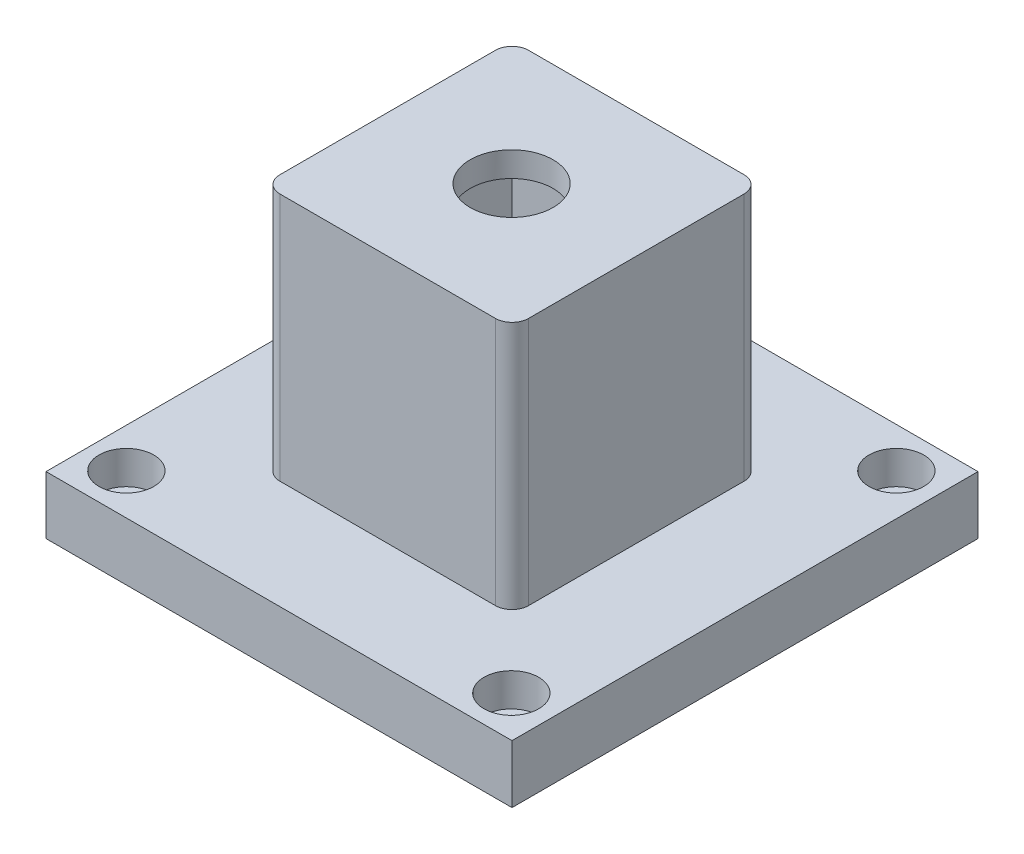
ISO-10303-21;
HEADER;
FILE_DESCRIPTION(('STEP AP214'),'2;1');
FILE_NAME('part.step','',(''),(''),'','','');
FILE_SCHEMA(('AUTOMOTIVE_DESIGN { 1 0 10303 214 1 1 1 1 }'));
ENDSEC;
DATA;
#1=APPLICATION_CONTEXT('core data for automotive mechanical design processes');
#2=APPLICATION_PROTOCOL_DEFINITION('international standard','automotive_design',2000,#1);
#3=PRODUCT_CONTEXT('',#1,'mechanical');
#4=PRODUCT('Part','Part','',(#3));
#5=PRODUCT_RELATED_PRODUCT_CATEGORY('part','',(#4));
#6=PRODUCT_DEFINITION_FORMATION('','',#4);
#7=PRODUCT_DEFINITION_CONTEXT('part definition',#1,'design');
#8=PRODUCT_DEFINITION('design','',#6,#7);
#9=PRODUCT_DEFINITION_SHAPE('','',#8);
#10=(LENGTH_UNIT() NAMED_UNIT(*) SI_UNIT(.MILLI.,.METRE.));
#11=(NAMED_UNIT(*) PLANE_ANGLE_UNIT() SI_UNIT($,.RADIAN.));
#12=(NAMED_UNIT(*) SI_UNIT($,.STERADIAN.) SOLID_ANGLE_UNIT());
#13=UNCERTAINTY_MEASURE_WITH_UNIT(LENGTH_MEASURE(1.E-05),#10,'distance_accuracy_value','');
#14=(GEOMETRIC_REPRESENTATION_CONTEXT(3) GLOBAL_UNCERTAINTY_ASSIGNED_CONTEXT((#13)) GLOBAL_UNIT_ASSIGNED_CONTEXT((#10,
#11,#12)) REPRESENTATION_CONTEXT('',''));
#15=CARTESIAN_POINT('',(0.,0.,0.));
#16=DIRECTION('',(0.,0.,1.));
#17=DIRECTION('',(1.,0.,0.));
#18=AXIS2_PLACEMENT_3D('',#15,#16,#17);
#19=CARTESIAN_POINT('',(-19.05,127.0508,0.));
#20=DIRECTION('',(-1.,0.,0.));
#21=DIRECTION('',(0.,0.,1.));
#22=AXIS2_PLACEMENT_3D('',#19,#20,#21);
#23=PLANE('',#22);
#24=DIRECTION('',(0.,0.,-1.));
#25=VECTOR('',#24,1.);
#26=CARTESIAN_POINT('',(-19.05,88.9508,0.));
#27=LINE('',#26,#25);
#28=CARTESIAN_POINT('',(-19.05,88.9508,16.51));
#29=VERTEX_POINT('',#28);
#30=CARTESIAN_POINT('',(-19.05,88.9508,-16.51));
#31=VERTEX_POINT('',#30);
#32=EDGE_CURVE('E153',#29,#31,#27,.T.);
#33=ORIENTED_EDGE('',*,*,#32,.F.);
#34=DIRECTION('',(0.,-1.,0.));
#35=VECTOR('',#34,1.);
#36=CARTESIAN_POINT('',(-19.05,127.0508,16.51));
#37=LINE('',#36,#35);
#38=CARTESIAN_POINT('',(-19.05,127.0508,16.51));
#39=VERTEX_POINT('',#38);
#40=EDGE_CURVE('E227',#29,#39,#37,.F.);
#41=ORIENTED_EDGE('',*,*,#40,.T.);
#42=DIRECTION('',(0.,0.,-1.));
#43=VECTOR('',#42,1.);
#44=CARTESIAN_POINT('',(-19.05,127.0508,0.));
#45=LINE('',#44,#43);
#46=CARTESIAN_POINT('',(-19.05,127.0508,-16.51));
#47=VERTEX_POINT('',#46);
#48=EDGE_CURVE('E186',#39,#47,#45,.T.);
#49=ORIENTED_EDGE('',*,*,#48,.T.);
#50=DIRECTION('',(0.,-1.,0.));
#51=VECTOR('',#50,1.);
#52=CARTESIAN_POINT('',(-19.05,127.0508,-16.51));
#53=LINE('',#52,#51);
#54=EDGE_CURVE('E224',#47,#31,#53,.T.);
#55=ORIENTED_EDGE('',*,*,#54,.T.);
#56=EDGE_LOOP('',(#33,#41,#49,#55));
#57=FACE_BOUND('',#56,.T.);
#58=ADVANCED_FACE('F52',(#57),#23,.T.);
#59=CARTESIAN_POINT('',(0.,127.0508,19.05));
#60=DIRECTION('',(0.,0.,1.));
#61=DIRECTION('',(1.,0.,0.));
#62=AXIS2_PLACEMENT_3D('',#59,#60,#61);
#63=PLANE('',#62);
#64=DIRECTION('',(-1.,0.,0.));
#65=VECTOR('',#64,1.);
#66=CARTESIAN_POINT('',(0.,127.0508,19.05));
#67=LINE('',#66,#65);
#68=CARTESIAN_POINT('',(16.51,127.0508,19.05));
#69=VERTEX_POINT('',#68);
#70=CARTESIAN_POINT('',(-16.51,127.0508,19.05));
#71=VERTEX_POINT('',#70);
#72=EDGE_CURVE('E195',#69,#71,#67,.T.);
#73=ORIENTED_EDGE('',*,*,#72,.T.);
#74=DIRECTION('',(0.,-1.,0.));
#75=VECTOR('',#74,1.);
#76=CARTESIAN_POINT('',(-16.51,127.0508,19.05));
#77=LINE('',#76,#75);
#78=CARTESIAN_POINT('',(-16.51,88.9508,19.05));
#79=VERTEX_POINT('',#78);
#80=EDGE_CURVE('E213',#71,#79,#77,.T.);
#81=ORIENTED_EDGE('',*,*,#80,.T.);
#82=DIRECTION('',(-1.,0.,0.));
#83=VECTOR('',#82,1.);
#84=CARTESIAN_POINT('',(0.,88.9508,19.05));
#85=LINE('',#84,#83);
#86=CARTESIAN_POINT('',(16.51,88.9508,19.05));
#87=VERTEX_POINT('',#86);
#88=EDGE_CURVE('E190',#87,#79,#85,.T.);
#89=ORIENTED_EDGE('',*,*,#88,.F.);
#90=DIRECTION('',(0.,-1.,0.));
#91=VECTOR('',#90,1.);
#92=CARTESIAN_POINT('',(16.51,127.0508,19.05));
#93=LINE('',#92,#91);
#94=EDGE_CURVE('E198',#87,#69,#93,.F.);
#95=ORIENTED_EDGE('',*,*,#94,.T.);
#96=EDGE_LOOP('',(#73,#81,#89,#95));
#97=FACE_BOUND('',#96,.T.);
#98=ADVANCED_FACE('F268',(#97),#63,.T.);
#99=CARTESIAN_POINT('',(19.05,127.0508,0.));
#100=DIRECTION('',(1.,0.,0.));
#101=DIRECTION('',(0.,0.,-1.));
#102=AXIS2_PLACEMENT_3D('',#99,#100,#101);
#103=PLANE('',#102);
#104=DIRECTION('',(0.,0.,1.));
#105=VECTOR('',#104,1.);
#106=CARTESIAN_POINT('',(19.05,88.9508,0.));
#107=LINE('',#106,#105);
#108=CARTESIAN_POINT('',(19.05,88.9508,-16.51));
#109=VERTEX_POINT('',#108);
#110=CARTESIAN_POINT('',(19.05,88.9508,16.51));
#111=VERTEX_POINT('',#110);
#112=EDGE_CURVE('E204',#109,#111,#107,.T.);
#113=ORIENTED_EDGE('',*,*,#112,.F.);
#114=DIRECTION('',(0.,-1.,0.));
#115=VECTOR('',#114,1.);
#116=CARTESIAN_POINT('',(19.05,127.0508,-16.51));
#117=LINE('',#116,#115);
#118=CARTESIAN_POINT('',(19.05,127.0508,-16.51));
#119=VERTEX_POINT('',#118);
#120=EDGE_CURVE('E13',#109,#119,#117,.F.);
#121=ORIENTED_EDGE('',*,*,#120,.T.);
#122=DIRECTION('',(0.,0.,1.));
#123=VECTOR('',#122,1.);
#124=CARTESIAN_POINT('',(19.05,127.0508,0.));
#125=LINE('',#124,#123);
#126=CARTESIAN_POINT('',(19.05,127.0508,16.51));
#127=VERTEX_POINT('',#126);
#128=EDGE_CURVE('E192',#119,#127,#125,.T.);
#129=ORIENTED_EDGE('',*,*,#128,.T.);
#130=DIRECTION('',(0.,-1.,0.));
#131=VECTOR('',#130,1.);
#132=CARTESIAN_POINT('',(19.05,127.0508,16.51));
#133=LINE('',#132,#131);
#134=EDGE_CURVE('E60',#127,#111,#133,.T.);
#135=ORIENTED_EDGE('',*,*,#134,.T.);
#136=EDGE_LOOP('',(#113,#121,#129,#135));
#137=FACE_BOUND('',#136,.T.);
#138=ADVANCED_FACE('F243',(#137),#103,.T.);
#139=CARTESIAN_POINT('',(0.,127.0508,-19.05));
#140=DIRECTION('',(0.,0.,-1.));
#141=DIRECTION('',(-1.,0.,0.));
#142=AXIS2_PLACEMENT_3D('',#139,#140,#141);
#143=PLANE('',#142);
#144=DIRECTION('',(1.,0.,0.));
#145=VECTOR('',#144,1.);
#146=CARTESIAN_POINT('',(0.,88.9508,-19.05));
#147=LINE('',#146,#145);
#148=CARTESIAN_POINT('',(-16.51,88.9508,-19.05));
#149=VERTEX_POINT('',#148);
#150=CARTESIAN_POINT('',(16.51,88.9508,-19.05));
#151=VERTEX_POINT('',#150);
#152=EDGE_CURVE('E201',#149,#151,#147,.T.);
#153=ORIENTED_EDGE('',*,*,#152,.F.);
#154=DIRECTION('',(0.,-1.,0.));
#155=VECTOR('',#154,1.);
#156=CARTESIAN_POINT('',(-16.51,127.0508,-19.05));
#157=LINE('',#156,#155);
#158=CARTESIAN_POINT('',(-16.51,127.0508,-19.05));
#159=VERTEX_POINT('',#158);
#160=EDGE_CURVE('E74',#149,#159,#157,.F.);
#161=ORIENTED_EDGE('',*,*,#160,.T.);
#162=DIRECTION('',(1.,0.,0.));
#163=VECTOR('',#162,1.);
#164=CARTESIAN_POINT('',(0.,127.0508,-19.05));
#165=LINE('',#164,#163);
#166=CARTESIAN_POINT('',(16.51,127.0508,-19.05));
#167=VERTEX_POINT('',#166);
#168=EDGE_CURVE('E189',#159,#167,#165,.T.);
#169=ORIENTED_EDGE('',*,*,#168,.T.);
#170=DIRECTION('',(0.,-1.,0.));
#171=VECTOR('',#170,1.);
#172=CARTESIAN_POINT('',(16.51,127.0508,-19.05));
#173=LINE('',#172,#171);
#174=EDGE_CURVE('E236',#167,#151,#173,.T.);
#175=ORIENTED_EDGE('',*,*,#174,.T.);
#176=EDGE_LOOP('',(#153,#161,#169,#175));
#177=FACE_BOUND('',#176,.T.);
#178=ADVANCED_FACE('F253',(#177),#143,.T.);
#179=CARTESIAN_POINT('',(0.,127.0508,0.));
#180=DIRECTION('',(0.,-1.,0.));
#181=DIRECTION('',(0.,0.,-1.));
#182=AXIS2_PLACEMENT_3D('',#179,#180,#181);
#183=PLANE('',#182);
#184=CARTESIAN_POINT('',(-0.128244477661507,127.0508,-0.0641222388311462));
#185=DIRECTION('',(0.,1.,0.));
#186=DIRECTION('',(0.,0.,1.));
#187=AXIS2_PLACEMENT_3D('',#184,#185,#186);
#188=CIRCLE('',#187,6.35);
#189=CARTESIAN_POINT('',(-0.128244477661507,127.0508,6.28587776116885));
#190=VERTEX_POINT('',#189);
#191=EDGE_CURVE('E211',#190,#190,#188,.T.);
#192=ORIENTED_EDGE('',*,*,#191,.F.);
#193=EDGE_LOOP('',(#192));
#194=FACE_BOUND('',#193,.T.);
#195=ORIENTED_EDGE('',*,*,#48,.F.);
#196=CARTESIAN_POINT('',(-16.51,127.0508,16.51));
#197=DIRECTION('',(0.,-1.,0.));
#198=DIRECTION('',(0.,0.,-1.));
#199=AXIS2_PLACEMENT_3D('',#196,#197,#198);
#200=CIRCLE('',#199,2.54);
#201=EDGE_CURVE('E234',#39,#71,#200,.F.);
#202=ORIENTED_EDGE('',*,*,#201,.T.);
#203=ORIENTED_EDGE('',*,*,#72,.F.);
#204=CARTESIAN_POINT('',(16.51,127.0508,16.51));
#205=DIRECTION('',(0.,-1.,0.));
#206=DIRECTION('',(0.,0.,-1.));
#207=AXIS2_PLACEMENT_3D('',#204,#205,#206);
#208=CIRCLE('',#207,2.54);
#209=EDGE_CURVE('E229',#69,#127,#208,.F.);
#210=ORIENTED_EDGE('',*,*,#209,.T.);
#211=ORIENTED_EDGE('',*,*,#128,.F.);
#212=CARTESIAN_POINT('',(16.51,127.0508,-16.51));
#213=DIRECTION('',(0.,-1.,0.));
#214=DIRECTION('',(0.,0.,-1.));
#215=AXIS2_PLACEMENT_3D('',#212,#213,#214);
#216=CIRCLE('',#215,2.54);
#217=EDGE_CURVE('E67',#119,#167,#216,.F.);
#218=ORIENTED_EDGE('',*,*,#217,.T.);
#219=ORIENTED_EDGE('',*,*,#168,.F.);
#220=CARTESIAN_POINT('',(-16.51,127.0508,-16.51));
#221=DIRECTION('',(0.,-1.,0.));
#222=DIRECTION('',(0.,0.,-1.));
#223=AXIS2_PLACEMENT_3D('',#220,#221,#222);
#224=CIRCLE('',#223,2.54);
#225=EDGE_CURVE('E232',#159,#47,#224,.F.);
#226=ORIENTED_EDGE('',*,*,#225,.T.);
#227=EDGE_LOOP('',(#195,#202,#203,#210,#211,#218,#219,#226));
#228=FACE_BOUND('',#227,.T.);
#229=ADVANCED_FACE('F256',(#194,#228),#183,.F.);
#230=CARTESIAN_POINT('',(0.,88.9508,0.));
#231=DIRECTION('',(0.,-1.,0.));
#232=DIRECTION('',(0.,0.,-1.));
#233=AXIS2_PLACEMENT_3D('',#230,#231,#232);
#234=PLANE('',#233);
#235=DIRECTION('',(0.,0.,-1.));
#236=VECTOR('',#235,1.);
#237=CARTESIAN_POINT('',(-15.24,88.9508,0.));
#238=LINE('',#237,#236);
#239=CARTESIAN_POINT('',(-15.24,88.9508,15.24));
#240=VERTEX_POINT('',#239);
#241=CARTESIAN_POINT('',(-15.24,88.9508,-15.24));
#242=VERTEX_POINT('',#241);
#243=EDGE_CURVE('E177',#240,#242,#238,.T.);
#244=ORIENTED_EDGE('',*,*,#243,.F.);
#245=DIRECTION('',(-1.,0.,0.));
#246=VECTOR('',#245,1.);
#247=CARTESIAN_POINT('',(0.,88.9508,15.24));
#248=LINE('',#247,#246);
#249=CARTESIAN_POINT('',(15.24,88.9508,15.24));
#250=VERTEX_POINT('',#249);
#251=EDGE_CURVE('E149',#250,#240,#248,.T.);
#252=ORIENTED_EDGE('',*,*,#251,.F.);
#253=DIRECTION('',(0.,0.,1.));
#254=VECTOR('',#253,1.);
#255=CARTESIAN_POINT('',(15.24,88.9508,0.));
#256=LINE('',#255,#254);
#257=CARTESIAN_POINT('',(15.24,88.9508,-15.24));
#258=VERTEX_POINT('',#257);
#259=EDGE_CURVE('E183',#258,#250,#256,.T.);
#260=ORIENTED_EDGE('',*,*,#259,.F.);
#261=DIRECTION('',(1.,0.,0.));
#262=VECTOR('',#261,1.);
#263=CARTESIAN_POINT('',(0.,88.9508,-15.24));
#264=LINE('',#263,#262);
#265=EDGE_CURVE('E179',#242,#258,#264,.T.);
#266=ORIENTED_EDGE('',*,*,#265,.F.);
#267=EDGE_LOOP('',(#244,#252,#260,#266));
#268=FACE_BOUND('',#267,.T.);
#269=ORIENTED_EDGE('',*,*,#88,.T.);
#270=CARTESIAN_POINT('',(-16.51,88.9508,16.51));
#271=DIRECTION('',(0.,-1.,0.));
#272=DIRECTION('',(0.,0.,-1.));
#273=AXIS2_PLACEMENT_3D('',#270,#271,#272);
#274=CIRCLE('',#273,2.54);
#275=EDGE_CURVE('E222',#79,#29,#274,.T.);
#276=ORIENTED_EDGE('',*,*,#275,.T.);
#277=ORIENTED_EDGE('',*,*,#32,.T.);
#278=CARTESIAN_POINT('',(-16.51,88.9508,-16.51));
#279=DIRECTION('',(0.,-1.,0.));
#280=DIRECTION('',(0.,0.,-1.));
#281=AXIS2_PLACEMENT_3D('',#278,#279,#280);
#282=CIRCLE('',#281,2.54);
#283=EDGE_CURVE('E220',#31,#149,#282,.T.);
#284=ORIENTED_EDGE('',*,*,#283,.T.);
#285=ORIENTED_EDGE('',*,*,#152,.T.);
#286=CARTESIAN_POINT('',(16.51,88.9508,-16.51));
#287=DIRECTION('',(0.,-1.,0.));
#288=DIRECTION('',(0.,0.,-1.));
#289=AXIS2_PLACEMENT_3D('',#286,#287,#288);
#290=CIRCLE('',#289,2.54);
#291=EDGE_CURVE('E218',#151,#109,#290,.T.);
#292=ORIENTED_EDGE('',*,*,#291,.T.);
#293=ORIENTED_EDGE('',*,*,#112,.T.);
#294=CARTESIAN_POINT('',(16.51,88.9508,16.51));
#295=DIRECTION('',(0.,-1.,0.));
#296=DIRECTION('',(0.,0.,-1.));
#297=AXIS2_PLACEMENT_3D('',#294,#295,#296);
#298=CIRCLE('',#297,2.54);
#299=EDGE_CURVE('E216',#111,#87,#298,.T.);
#300=ORIENTED_EDGE('',*,*,#299,.T.);
#301=EDGE_LOOP('',(#269,#276,#277,#284,#285,#292,#293,#300));
#302=FACE_BOUND('',#301,.T.);
#303=ADVANCED_FACE('F248',(#268,#302),#234,.T.);
#304=CARTESIAN_POINT('',(-15.24,127.0508,0.));
#305=DIRECTION('',(-1.,0.,0.));
#306=DIRECTION('',(0.,0.,1.));
#307=AXIS2_PLACEMENT_3D('',#304,#305,#306);
#308=PLANE('',#307);
#309=ORIENTED_EDGE('',*,*,#243,.T.);
#310=DIRECTION('',(0.,-1.,0.));
#311=VECTOR('',#310,1.);
#312=CARTESIAN_POINT('',(-15.24,127.0508,-15.24));
#313=LINE('',#312,#311);
#314=CARTESIAN_POINT('',(-15.24,123.2408,-15.24));
#315=VERTEX_POINT('',#314);
#316=EDGE_CURVE('E159',#315,#242,#313,.T.);
#317=ORIENTED_EDGE('',*,*,#316,.F.);
#318=DIRECTION('',(0.,0.,-1.));
#319=VECTOR('',#318,1.);
#320=CARTESIAN_POINT('',(-15.24,123.2408,0.));
#321=LINE('',#320,#319);
#322=CARTESIAN_POINT('',(-15.24,123.2408,15.24));
#323=VERTEX_POINT('',#322);
#324=EDGE_CURVE('E157',#323,#315,#321,.T.);
#325=ORIENTED_EDGE('',*,*,#324,.F.);
#326=DIRECTION('',(0.,-1.,0.));
#327=VECTOR('',#326,1.);
#328=CARTESIAN_POINT('',(-15.24,127.0508,15.24));
#329=LINE('',#328,#327);
#330=EDGE_CURVE('E142',#323,#240,#329,.T.);
#331=ORIENTED_EDGE('',*,*,#330,.T.);
#332=EDGE_LOOP('',(#309,#317,#325,#331));
#333=FACE_BOUND('',#332,.T.);
#334=ADVANCED_FACE('F158',(#333),#308,.F.);
#335=CARTESIAN_POINT('',(0.,127.0508,15.24));
#336=DIRECTION('',(0.,0.,1.));
#337=DIRECTION('',(1.,0.,0.));
#338=AXIS2_PLACEMENT_3D('',#335,#336,#337);
#339=PLANE('',#338);
#340=ORIENTED_EDGE('',*,*,#251,.T.);
#341=ORIENTED_EDGE('',*,*,#330,.F.);
#342=DIRECTION('',(-1.,0.,0.));
#343=VECTOR('',#342,1.);
#344=CARTESIAN_POINT('',(0.,123.2408,15.24));
#345=LINE('',#344,#343);
#346=CARTESIAN_POINT('',(15.24,123.2408,15.24));
#347=VERTEX_POINT('',#346);
#348=EDGE_CURVE('E147',#347,#323,#345,.T.);
#349=ORIENTED_EDGE('',*,*,#348,.F.);
#350=DIRECTION('',(0.,-1.,0.));
#351=VECTOR('',#350,1.);
#352=CARTESIAN_POINT('',(15.24,127.0508,15.24));
#353=LINE('',#352,#351);
#354=EDGE_CURVE('E154',#347,#250,#353,.T.);
#355=ORIENTED_EDGE('',*,*,#354,.T.);
#356=EDGE_LOOP('',(#340,#341,#349,#355));
#357=FACE_BOUND('',#356,.T.);
#358=ADVANCED_FACE('F144',(#357),#339,.F.);
#359=CARTESIAN_POINT('',(15.24,127.0508,0.));
#360=DIRECTION('',(1.,0.,0.));
#361=DIRECTION('',(0.,0.,-1.));
#362=AXIS2_PLACEMENT_3D('',#359,#360,#361);
#363=PLANE('',#362);
#364=ORIENTED_EDGE('',*,*,#259,.T.);
#365=ORIENTED_EDGE('',*,*,#354,.F.);
#366=DIRECTION('',(0.,0.,1.));
#367=VECTOR('',#366,1.);
#368=CARTESIAN_POINT('',(15.24,123.2408,0.));
#369=LINE('',#368,#367);
#370=CARTESIAN_POINT('',(15.24,123.2408,-15.24));
#371=VERTEX_POINT('',#370);
#372=EDGE_CURVE('E168',#371,#347,#369,.T.);
#373=ORIENTED_EDGE('',*,*,#372,.F.);
#374=DIRECTION('',(0.,-1.,0.));
#375=VECTOR('',#374,1.);
#376=CARTESIAN_POINT('',(15.24,127.0508,-15.24));
#377=LINE('',#376,#375);
#378=EDGE_CURVE('E170',#371,#258,#377,.T.);
#379=ORIENTED_EDGE('',*,*,#378,.T.);
#380=EDGE_LOOP('',(#364,#365,#373,#379));
#381=FACE_BOUND('',#380,.T.);
#382=ADVANCED_FACE('F334',(#381),#363,.F.);
#383=CARTESIAN_POINT('',(0.,127.0508,-15.24));
#384=DIRECTION('',(0.,0.,-1.));
#385=DIRECTION('',(-1.,0.,0.));
#386=AXIS2_PLACEMENT_3D('',#383,#384,#385);
#387=PLANE('',#386);
#388=ORIENTED_EDGE('',*,*,#265,.T.);
#389=ORIENTED_EDGE('',*,*,#378,.F.);
#390=DIRECTION('',(1.,0.,0.));
#391=VECTOR('',#390,1.);
#392=CARTESIAN_POINT('',(0.,123.2408,-15.24));
#393=LINE('',#392,#391);
#394=EDGE_CURVE('E163',#315,#371,#393,.T.);
#395=ORIENTED_EDGE('',*,*,#394,.F.);
#396=ORIENTED_EDGE('',*,*,#316,.T.);
#397=EDGE_LOOP('',(#388,#389,#395,#396));
#398=FACE_BOUND('',#397,.T.);
#399=ADVANCED_FACE('F325',(#398),#387,.F.);
#400=CARTESIAN_POINT('',(0.,123.2408,0.));
#401=DIRECTION('',(0.,-1.,0.));
#402=DIRECTION('',(0.,0.,-1.));
#403=AXIS2_PLACEMENT_3D('',#400,#401,#402);
#404=PLANE('',#403);
#405=CARTESIAN_POINT('',(-0.128244477661507,123.2408,-0.0641222388311462));
#406=DIRECTION('',(0.,-1.,0.));
#407=DIRECTION('',(0.,0.,-1.));
#408=AXIS2_PLACEMENT_3D('',#405,#406,#407);
#409=CIRCLE('',#408,6.35);
#410=CARTESIAN_POINT('',(-0.128244477661507,123.2408,-6.41412223883115));
#411=VERTEX_POINT('',#410);
#412=EDGE_CURVE('E180',#411,#411,#409,.T.);
#413=ORIENTED_EDGE('',*,*,#412,.F.);
#414=EDGE_LOOP('',(#413));
#415=FACE_BOUND('',#414,.T.);
#416=ORIENTED_EDGE('',*,*,#324,.T.);
#417=ORIENTED_EDGE('',*,*,#394,.T.);
#418=ORIENTED_EDGE('',*,*,#372,.T.);
#419=ORIENTED_EDGE('',*,*,#348,.T.);
#420=EDGE_LOOP('',(#416,#417,#418,#419));
#421=FACE_BOUND('',#420,.T.);
#422=ADVANCED_FACE('F166',(#415,#421),#404,.T.);
#423=CARTESIAN_POINT('',(-0.128244477661507,107.7468,-0.0641222388311462));
#424=DIRECTION('',(0.,1.,0.));
#425=DIRECTION('',(0.,0.,1.));
#426=AXIS2_PLACEMENT_3D('',#423,#424,#425);
#427=CYLINDRICAL_SURFACE('',#426,6.35);
#428=ORIENTED_EDGE('',*,*,#412,.T.);
#429=EDGE_LOOP('',(#428));
#430=FACE_BOUND('',#429,.T.);
#431=ORIENTED_EDGE('',*,*,#191,.T.);
#432=EDGE_LOOP('',(#431));
#433=FACE_BOUND('',#432,.T.);
#434=ADVANCED_FACE('F286',(#430,#433),#427,.F.);
#435=CARTESIAN_POINT('',(-16.51,127.0508,16.51));
#436=DIRECTION('',(0.,-1.,0.));
#437=DIRECTION('',(0.,0.,-1.));
#438=AXIS2_PLACEMENT_3D('',#435,#436,#437);
#439=CYLINDRICAL_SURFACE('',#438,2.54);
#440=ORIENTED_EDGE('',*,*,#201,.F.);
#441=ORIENTED_EDGE('',*,*,#40,.F.);
#442=ORIENTED_EDGE('',*,*,#275,.F.);
#443=ORIENTED_EDGE('',*,*,#80,.F.);
#444=EDGE_LOOP('',(#440,#441,#442,#443));
#445=FACE_BOUND('',#444,.T.);
#446=ADVANCED_FACE('F266',(#445),#439,.T.);
#447=CARTESIAN_POINT('',(-16.51,127.0508,-16.51));
#448=DIRECTION('',(0.,-1.,0.));
#449=DIRECTION('',(0.,0.,-1.));
#450=AXIS2_PLACEMENT_3D('',#447,#448,#449);
#451=CYLINDRICAL_SURFACE('',#450,2.54);
#452=ORIENTED_EDGE('',*,*,#225,.F.);
#453=ORIENTED_EDGE('',*,*,#160,.F.);
#454=ORIENTED_EDGE('',*,*,#283,.F.);
#455=ORIENTED_EDGE('',*,*,#54,.F.);
#456=EDGE_LOOP('',(#452,#453,#454,#455));
#457=FACE_BOUND('',#456,.T.);
#458=ADVANCED_FACE('F259',(#457),#451,.T.);
#459=CARTESIAN_POINT('',(16.51,127.0508,-16.51));
#460=DIRECTION('',(0.,-1.,0.));
#461=DIRECTION('',(0.,0.,-1.));
#462=AXIS2_PLACEMENT_3D('',#459,#460,#461);
#463=CYLINDRICAL_SURFACE('',#462,2.54);
#464=ORIENTED_EDGE('',*,*,#217,.F.);
#465=ORIENTED_EDGE('',*,*,#120,.F.);
#466=ORIENTED_EDGE('',*,*,#291,.F.);
#467=ORIENTED_EDGE('',*,*,#174,.F.);
#468=EDGE_LOOP('',(#464,#465,#466,#467));
#469=FACE_BOUND('',#468,.T.);
#470=ADVANCED_FACE('F252',(#469),#463,.T.);
#471=CARTESIAN_POINT('',(16.51,127.0508,16.51));
#472=DIRECTION('',(0.,-1.,0.));
#473=DIRECTION('',(0.,0.,-1.));
#474=AXIS2_PLACEMENT_3D('',#471,#472,#473);
#475=CYLINDRICAL_SURFACE('',#474,2.54);
#476=ORIENTED_EDGE('',*,*,#209,.F.);
#477=ORIENTED_EDGE('',*,*,#94,.F.);
#478=ORIENTED_EDGE('',*,*,#299,.F.);
#479=ORIENTED_EDGE('',*,*,#134,.F.);
#480=EDGE_LOOP('',(#476,#477,#478,#479));
#481=FACE_BOUND('',#480,.T.);
#482=ADVANCED_FACE('F54',(#481),#475,.T.);
#483=CLOSED_SHELL('',(#58,#98,#138,#178,#229,#303,#334,#358,#382,#399,#422,#434,#446,#458,#470,#482));
#484=MANIFOLD_SOLID_BREP('B2',#483);
#485=CARTESIAN_POINT('',(-29.4812110895342,80.0608,29.4812110895342));
#486=DIRECTION('',(0.,1.,0.));
#487=DIRECTION('',(0.,0.,1.));
#488=AXIS2_PLACEMENT_3D('',#485,#486,#487);
#489=CYLINDRICAL_SURFACE('',#488,3.175);
#490=CARTESIAN_POINT('',(-29.4812110895342,80.0608,29.4812110895342));
#491=DIRECTION('',(0.,1.,0.));
#492=DIRECTION('',(0.,0.,1.));
#493=AXIS2_PLACEMENT_3D('',#490,#491,#492);
#494=CIRCLE('',#493,3.175);
#495=CARTESIAN_POINT('',(-29.4812110895342,80.0608,32.6562110895342));
#496=VERTEX_POINT('',#495);
#497=EDGE_CURVE('E598',#496,#496,#494,.T.);
#498=ORIENTED_EDGE('',*,*,#497,.F.);
#499=EDGE_LOOP('',(#498));
#500=FACE_BOUND('',#499,.T.);
#501=CARTESIAN_POINT('',(-29.4812110895342,83.8708,29.4812110895342));
#502=DIRECTION('',(0.,1.,0.));
#503=DIRECTION('',(0.,0.,1.));
#504=AXIS2_PLACEMENT_3D('',#501,#502,#503);
#505=CIRCLE('',#504,3.175);
#506=CARTESIAN_POINT('',(-29.4812110895342,83.8708,32.6562110895342));
#507=VERTEX_POINT('',#506);
#508=EDGE_CURVE('E420',#507,#507,#505,.F.);
#509=ORIENTED_EDGE('',*,*,#508,.F.);
#510=EDGE_LOOP('',(#509));
#511=FACE_BOUND('',#510,.T.);
#512=ADVANCED_FACE('F416',(#500,#511),#489,.F.);
#513=CARTESIAN_POINT('',(29.4847950216924,80.0608,-29.4847950216924));
#514=DIRECTION('',(0.,1.,0.));
#515=DIRECTION('',(0.,0.,1.));
#516=AXIS2_PLACEMENT_3D('',#513,#514,#515);
#517=CYLINDRICAL_SURFACE('',#516,3.175);
#518=CARTESIAN_POINT('',(29.4847950216924,80.0608,-29.4847950216924));
#519=DIRECTION('',(0.,1.,0.));
#520=DIRECTION('',(0.,0.,1.));
#521=AXIS2_PLACEMENT_3D('',#518,#519,#520);
#522=CIRCLE('',#521,3.175);
#523=CARTESIAN_POINT('',(29.4847950216924,80.0608,-26.3097950216924));
#524=VERTEX_POINT('',#523);
#525=EDGE_CURVE('E594',#524,#524,#522,.T.);
#526=ORIENTED_EDGE('',*,*,#525,.F.);
#527=EDGE_LOOP('',(#526));
#528=FACE_BOUND('',#527,.T.);
#529=CARTESIAN_POINT('',(29.4847950216924,83.8708,-29.4847950216924));
#530=DIRECTION('',(0.,1.,0.));
#531=DIRECTION('',(0.,0.,1.));
#532=AXIS2_PLACEMENT_3D('',#529,#530,#531);
#533=CIRCLE('',#532,3.175);
#534=CARTESIAN_POINT('',(29.4847950216924,83.8708,-26.3097950216924));
#535=VERTEX_POINT('',#534);
#536=EDGE_CURVE('E576',#535,#535,#533,.F.);
#537=ORIENTED_EDGE('',*,*,#536,.F.);
#538=EDGE_LOOP('',(#537));
#539=FACE_BOUND('',#538,.T.);
#540=ADVANCED_FACE('F684',(#528,#539),#517,.F.);
#541=CARTESIAN_POINT('',(-29.4825135870935,80.0608,-29.4825135870935));
#542=DIRECTION('',(0.,1.,0.));
#543=DIRECTION('',(0.,0.,1.));
#544=AXIS2_PLACEMENT_3D('',#541,#542,#543);
#545=CYLINDRICAL_SURFACE('',#544,3.175);
#546=CARTESIAN_POINT('',(-29.4825135870935,80.0608,-29.4825135870935));
#547=DIRECTION('',(0.,1.,0.));
#548=DIRECTION('',(0.,0.,1.));
#549=AXIS2_PLACEMENT_3D('',#546,#547,#548);
#550=CIRCLE('',#549,3.175);
#551=CARTESIAN_POINT('',(-29.4825135870935,80.0608,-26.3075135870935));
#552=VERTEX_POINT('',#551);
#553=EDGE_CURVE('E588',#552,#552,#550,.T.);
#554=ORIENTED_EDGE('',*,*,#553,.F.);
#555=EDGE_LOOP('',(#554));
#556=FACE_BOUND('',#555,.T.);
#557=CARTESIAN_POINT('',(-29.4825135870935,83.8708,-29.4825135870935));
#558=DIRECTION('',(0.,1.,0.));
#559=DIRECTION('',(0.,0.,1.));
#560=AXIS2_PLACEMENT_3D('',#557,#558,#559);
#561=CIRCLE('',#560,3.175);
#562=CARTESIAN_POINT('',(-29.4825135870935,83.8708,-26.3075135870935));
#563=VERTEX_POINT('',#562);
#564=EDGE_CURVE('E572',#563,#563,#561,.F.);
#565=ORIENTED_EDGE('',*,*,#564,.F.);
#566=EDGE_LOOP('',(#565));
#567=FACE_BOUND('',#566,.T.);
#568=ADVANCED_FACE('F690',(#556,#567),#545,.F.);
#569=CARTESIAN_POINT('',(29.4847950216924,80.0608,29.4847950216924));
#570=DIRECTION('',(0.,1.,0.));
#571=DIRECTION('',(0.,0.,1.));
#572=AXIS2_PLACEMENT_3D('',#569,#570,#571);
#573=CYLINDRICAL_SURFACE('',#572,3.175);
#574=CARTESIAN_POINT('',(29.4847950216924,80.0608,29.4847950216924));
#575=DIRECTION('',(0.,1.,0.));
#576=DIRECTION('',(0.,0.,1.));
#577=AXIS2_PLACEMENT_3D('',#574,#575,#576);
#578=CIRCLE('',#577,3.175);
#579=CARTESIAN_POINT('',(29.4847950216924,80.0608,32.6597950216924));
#580=VERTEX_POINT('',#579);
#581=EDGE_CURVE('E583',#580,#580,#578,.T.);
#582=ORIENTED_EDGE('',*,*,#581,.F.);
#583=EDGE_LOOP('',(#582));
#584=FACE_BOUND('',#583,.T.);
#585=CARTESIAN_POINT('',(29.4847950216924,83.8708,29.4847950216924));
#586=DIRECTION('',(0.,1.,0.));
#587=DIRECTION('',(0.,0.,1.));
#588=AXIS2_PLACEMENT_3D('',#585,#586,#587);
#589=CIRCLE('',#588,3.175);
#590=CARTESIAN_POINT('',(29.4847950216924,83.8708,32.6597950216924));
#591=VERTEX_POINT('',#590);
#592=EDGE_CURVE('E568',#591,#591,#589,.F.);
#593=ORIENTED_EDGE('',*,*,#592,.F.);
#594=EDGE_LOOP('',(#593));
#595=FACE_BOUND('',#594,.T.);
#596=ADVANCED_FACE('F697',(#584,#595),#573,.F.);
#597=CARTESIAN_POINT('',(35.687,88.9508,-35.687));
#598=DIRECTION('',(-1.,0.,0.));
#599=DIRECTION('',(0.,0.,1.));
#600=AXIS2_PLACEMENT_3D('',#597,#598,#599);
#601=PLANE('',#600);
#602=DIRECTION('',(0.,0.,1.));
#603=VECTOR('',#602,1.);
#604=CARTESIAN_POINT('',(35.687,80.0608,-35.687));
#605=LINE('',#604,#603);
#606=CARTESIAN_POINT('',(35.687,80.0608,-35.687));
#607=VERTEX_POINT('',#606);
#608=CARTESIAN_POINT('',(35.687,80.0608,35.687));
#609=VERTEX_POINT('',#608);
#610=EDGE_CURVE('E538',#607,#609,#605,.T.);
#611=ORIENTED_EDGE('',*,*,#610,.F.);
#612=DIRECTION('',(0.,-1.,0.));
#613=VECTOR('',#612,1.);
#614=CARTESIAN_POINT('',(35.687,88.9508,-35.687));
#615=LINE('',#614,#613);
#616=CARTESIAN_POINT('',(35.687,88.9508,-35.687));
#617=VERTEX_POINT('',#616);
#618=EDGE_CURVE('E50',#617,#607,#615,.T.);
#619=ORIENTED_EDGE('',*,*,#618,.F.);
#620=DIRECTION('',(0.,0.,-1.));
#621=VECTOR('',#620,1.);
#622=CARTESIAN_POINT('',(35.687,88.9508,-35.687));
#623=LINE('',#622,#621);
#624=CARTESIAN_POINT('',(35.687,88.9508,35.687));
#625=VERTEX_POINT('',#624);
#626=EDGE_CURVE('E541',#625,#617,#623,.T.);
#627=ORIENTED_EDGE('',*,*,#626,.F.);
#628=DIRECTION('',(0.,-1.,0.));
#629=VECTOR('',#628,1.);
#630=CARTESIAN_POINT('',(35.687,88.9508,35.687));
#631=LINE('',#630,#629);
#632=EDGE_CURVE('E557',#625,#609,#631,.T.);
#633=ORIENTED_EDGE('',*,*,#632,.T.);
#634=EDGE_LOOP('',(#611,#619,#627,#633));
#635=FACE_BOUND('',#634,.T.);
#636=ADVANCED_FACE('F418',(#635),#601,.F.);
#637=CARTESIAN_POINT('',(-35.687,88.9508,-35.687));
#638=DIRECTION('',(0.,0.,1.));
#639=DIRECTION('',(1.,0.,0.));
#640=AXIS2_PLACEMENT_3D('',#637,#638,#639);
#641=PLANE('',#640);
#642=DIRECTION('',(1.,0.,0.));
#643=VECTOR('',#642,1.);
#644=CARTESIAN_POINT('',(-35.687,80.0608,-35.687));
#645=LINE('',#644,#643);
#646=CARTESIAN_POINT('',(-35.687,80.0608,-35.687));
#647=VERTEX_POINT('',#646);
#648=EDGE_CURVE('E531',#647,#607,#645,.T.);
#649=ORIENTED_EDGE('',*,*,#648,.F.);
#650=DIRECTION('',(0.,-1.,0.));
#651=VECTOR('',#650,1.);
#652=CARTESIAN_POINT('',(-35.687,88.9508,-35.687));
#653=LINE('',#652,#651);
#654=CARTESIAN_POINT('',(-35.687,88.9508,-35.687));
#655=VERTEX_POINT('',#654);
#656=EDGE_CURVE('E426',#655,#647,#653,.T.);
#657=ORIENTED_EDGE('',*,*,#656,.F.);
#658=DIRECTION('',(-1.,0.,0.));
#659=VECTOR('',#658,1.);
#660=CARTESIAN_POINT('',(-35.687,88.9508,-35.687));
#661=LINE('',#660,#659);
#662=EDGE_CURVE('E548',#617,#655,#661,.T.);
#663=ORIENTED_EDGE('',*,*,#662,.F.);
#664=ORIENTED_EDGE('',*,*,#618,.T.);
#665=EDGE_LOOP('',(#649,#657,#663,#664));
#666=FACE_BOUND('',#665,.T.);
#667=ADVANCED_FACE('F668',(#666),#641,.F.);
#668=CARTESIAN_POINT('',(-35.687,88.9508,-35.687));
#669=DIRECTION('',(1.,0.,0.));
#670=DIRECTION('',(0.,0.,-1.));
#671=AXIS2_PLACEMENT_3D('',#668,#669,#670);
#672=PLANE('',#671);
#673=DIRECTION('',(0.,0.,1.));
#674=VECTOR('',#673,1.);
#675=CARTESIAN_POINT('',(-35.687,80.0608,-35.687));
#676=LINE('',#675,#674);
#677=CARTESIAN_POINT('',(-35.687,80.0608,35.687));
#678=VERTEX_POINT('',#677);
#679=EDGE_CURVE('E534',#647,#678,#676,.T.);
#680=ORIENTED_EDGE('',*,*,#679,.T.);
#681=DIRECTION('',(0.,-1.,0.));
#682=VECTOR('',#681,1.);
#683=CARTESIAN_POINT('',(-35.687,88.9508,35.687));
#684=LINE('',#683,#682);
#685=CARTESIAN_POINT('',(-35.687,88.9508,35.687));
#686=VERTEX_POINT('',#685);
#687=EDGE_CURVE('E561',#686,#678,#684,.T.);
#688=ORIENTED_EDGE('',*,*,#687,.F.);
#689=DIRECTION('',(0.,0.,1.));
#690=VECTOR('',#689,1.);
#691=CARTESIAN_POINT('',(-35.687,88.9508,-35.687));
#692=LINE('',#691,#690);
#693=EDGE_CURVE('E551',#655,#686,#692,.T.);
#694=ORIENTED_EDGE('',*,*,#693,.F.);
#695=ORIENTED_EDGE('',*,*,#656,.T.);
#696=EDGE_LOOP('',(#680,#688,#694,#695));
#697=FACE_BOUND('',#696,.T.);
#698=ADVANCED_FACE('F672',(#697),#672,.F.);
#699=CARTESIAN_POINT('',(-35.687,88.9508,35.687));
#700=DIRECTION('',(0.,0.,-1.));
#701=DIRECTION('',(-1.,0.,0.));
#702=AXIS2_PLACEMENT_3D('',#699,#700,#701);
#703=PLANE('',#702);
#704=DIRECTION('',(1.,0.,0.));
#705=VECTOR('',#704,1.);
#706=CARTESIAN_POINT('',(-35.687,80.0608,35.687));
#707=LINE('',#706,#705);
#708=EDGE_CURVE('E530',#678,#609,#707,.T.);
#709=ORIENTED_EDGE('',*,*,#708,.T.);
#710=ORIENTED_EDGE('',*,*,#632,.F.);
#711=DIRECTION('',(1.,0.,0.));
#712=VECTOR('',#711,1.);
#713=CARTESIAN_POINT('',(-35.687,88.9508,35.687));
#714=LINE('',#713,#712);
#715=EDGE_CURVE('E554',#686,#625,#714,.T.);
#716=ORIENTED_EDGE('',*,*,#715,.F.);
#717=ORIENTED_EDGE('',*,*,#687,.T.);
#718=EDGE_LOOP('',(#709,#710,#716,#717));
#719=FACE_BOUND('',#718,.T.);
#720=ADVANCED_FACE('F651',(#719),#703,.F.);
#721=CARTESIAN_POINT('',(0.,88.9508,0.));
#722=DIRECTION('',(0.,1.,0.));
#723=DIRECTION('',(0.,0.,1.));
#724=AXIS2_PLACEMENT_3D('',#721,#722,#723);
#725=PLANE('',#724);
#726=CARTESIAN_POINT('',(29.322292144694,88.9508,29.4224751947066));
#727=DIRECTION('',(0.,1.,0.));
#728=DIRECTION('',(0.,0.,1.));
#729=AXIS2_PLACEMENT_3D('',#726,#727,#728);
#730=CIRCLE('',#729,4.191);
#731=CARTESIAN_POINT('',(29.322292144694,88.9508,33.6134751947066));
#732=VERTEX_POINT('',#731);
#733=EDGE_CURVE('E615',#732,#732,#730,.T.);
#734=ORIENTED_EDGE('',*,*,#733,.F.);
#735=EDGE_LOOP('',(#734));
#736=FACE_BOUND('',#735,.T.);
#737=CARTESIAN_POINT('',(-29.6450164640919,88.9508,-29.5448334140793));
#738=DIRECTION('',(0.,1.,0.));
#739=DIRECTION('',(0.,0.,1.));
#740=AXIS2_PLACEMENT_3D('',#737,#738,#739);
#741=CIRCLE('',#740,4.191);
#742=CARTESIAN_POINT('',(-29.6450164640919,88.9508,-25.3538334140793));
#743=VERTEX_POINT('',#742);
#744=EDGE_CURVE('E623',#743,#743,#741,.T.);
#745=ORIENTED_EDGE('',*,*,#744,.F.);
#746=EDGE_LOOP('',(#745));
#747=FACE_BOUND('',#746,.T.);
#748=CARTESIAN_POINT('',(29.322292144694,88.9508,-29.5471148486782));
#749=DIRECTION('',(0.,1.,0.));
#750=DIRECTION('',(0.,0.,1.));
#751=AXIS2_PLACEMENT_3D('',#748,#749,#750);
#752=CIRCLE('',#751,4.191);
#753=CARTESIAN_POINT('',(29.322292144694,88.9508,-25.3561148486782));
#754=VERTEX_POINT('',#753);
#755=EDGE_CURVE('E631',#754,#754,#752,.T.);
#756=ORIENTED_EDGE('',*,*,#755,.F.);
#757=EDGE_LOOP('',(#756));
#758=FACE_BOUND('',#757,.T.);
#759=CARTESIAN_POINT('',(-29.6437139665326,88.9508,29.4188912625483));
#760=DIRECTION('',(0.,1.,0.));
#761=DIRECTION('',(0.,0.,1.));
#762=AXIS2_PLACEMENT_3D('',#759,#760,#761);
#763=CIRCLE('',#762,4.191);
#764=CARTESIAN_POINT('',(-29.6437139665326,88.9508,33.6098912625484));
#765=VERTEX_POINT('',#764);
#766=EDGE_CURVE('E607',#765,#765,#763,.T.);
#767=ORIENTED_EDGE('',*,*,#766,.F.);
#768=EDGE_LOOP('',(#767));
#769=FACE_BOUND('',#768,.T.);
#770=DIRECTION('',(1.,0.,0.));
#771=VECTOR('',#770,1.);
#772=CARTESIAN_POINT('',(0.,88.9508,15.0366650058129));
#773=LINE('',#772,#771);
#774=CARTESIAN_POINT('',(-15.0366650058129,88.9508,15.0366650058129));
#775=VERTEX_POINT('',#774);
#776=CARTESIAN_POINT('',(15.1052757834077,88.9508,15.0366650058129));
#777=VERTEX_POINT('',#776);
#778=EDGE_CURVE('E527',#775,#777,#773,.T.);
#779=ORIENTED_EDGE('',*,*,#778,.F.);
#780=DIRECTION('',(0.,0.,1.));
#781=VECTOR('',#780,1.);
#782=CARTESIAN_POINT('',(-15.0366650058129,88.9508,0.));
#783=LINE('',#782,#781);
#784=CARTESIAN_POINT('',(-15.0366650058129,88.9508,-15.0366650058129));
#785=VERTEX_POINT('',#784);
#786=EDGE_CURVE('E515',#785,#775,#783,.T.);
#787=ORIENTED_EDGE('',*,*,#786,.F.);
#788=DIRECTION('',(-1.,0.,0.));
#789=VECTOR('',#788,1.);
#790=CARTESIAN_POINT('',(0.,88.9508,-15.0366650058129));
#791=LINE('',#790,#789);
#792=CARTESIAN_POINT('',(15.1052757834077,88.9508,-15.0366650058129));
#793=VERTEX_POINT('',#792);
#794=EDGE_CURVE('E490',#793,#785,#791,.T.);
#795=ORIENTED_EDGE('',*,*,#794,.F.);
#796=DIRECTION('',(0.,0.,-1.));
#797=VECTOR('',#796,1.);
#798=CARTESIAN_POINT('',(15.1052757834077,88.9508,0.));
#799=LINE('',#798,#797);
#800=EDGE_CURVE('E524',#777,#793,#799,.T.);
#801=ORIENTED_EDGE('',*,*,#800,.F.);
#802=EDGE_LOOP('',(#779,#787,#795,#801));
#803=FACE_BOUND('',#802,.T.);
#804=ORIENTED_EDGE('',*,*,#626,.T.);
#805=ORIENTED_EDGE('',*,*,#662,.T.);
#806=ORIENTED_EDGE('',*,*,#693,.T.);
#807=ORIENTED_EDGE('',*,*,#715,.T.);
#808=EDGE_LOOP('',(#804,#805,#806,#807));
#809=FACE_BOUND('',#808,.T.);
#810=ADVANCED_FACE('F648',(#736,#747,#758,#769,#803,#809),#725,.T.);
#811=CARTESIAN_POINT('',(-35.687,80.0608,-35.687));
#812=DIRECTION('',(0.,-1.,0.));
#813=DIRECTION('',(0.,0.,-1.));
#814=AXIS2_PLACEMENT_3D('',#811,#812,#813);
#815=PLANE('',#814);
#816=ORIENTED_EDGE('',*,*,#581,.T.);
#817=EDGE_LOOP('',(#816));
#818=FACE_BOUND('',#817,.T.);
#819=ORIENTED_EDGE('',*,*,#553,.T.);
#820=EDGE_LOOP('',(#819));
#821=FACE_BOUND('',#820,.T.);
#822=ORIENTED_EDGE('',*,*,#525,.T.);
#823=EDGE_LOOP('',(#822));
#824=FACE_BOUND('',#823,.T.);
#825=ORIENTED_EDGE('',*,*,#497,.T.);
#826=EDGE_LOOP('',(#825));
#827=FACE_BOUND('',#826,.T.);
#828=DIRECTION('',(-1.,0.,0.));
#829=VECTOR('',#828,1.);
#830=CARTESIAN_POINT('',(-15.0366650058129,80.0608,15.0366650058129));
#831=LINE('',#830,#829);
#832=CARTESIAN_POINT('',(15.1052757834077,80.0608,15.0366650058129));
#833=VERTEX_POINT('',#832);
#834=CARTESIAN_POINT('',(-15.0366650058129,80.0608,15.0366650058129));
#835=VERTEX_POINT('',#834);
#836=EDGE_CURVE('E442',#833,#835,#831,.T.);
#837=ORIENTED_EDGE('',*,*,#836,.F.);
#838=DIRECTION('',(0.,0.,1.));
#839=VECTOR('',#838,1.);
#840=CARTESIAN_POINT('',(15.1052757834077,80.0608,15.0366650058129));
#841=LINE('',#840,#839);
#842=CARTESIAN_POINT('',(15.1052757834077,80.0608,-15.0366650058129));
#843=VERTEX_POINT('',#842);
#844=EDGE_CURVE('E505',#843,#833,#841,.T.);
#845=ORIENTED_EDGE('',*,*,#844,.F.);
#846=DIRECTION('',(1.,0.,0.));
#847=VECTOR('',#846,1.);
#848=CARTESIAN_POINT('',(-15.0366650058129,80.0608,-15.0366650058129));
#849=LINE('',#848,#847);
#850=CARTESIAN_POINT('',(-15.0366650058129,80.0608,-15.0366650058129));
#851=VERTEX_POINT('',#850);
#852=EDGE_CURVE('E487',#851,#843,#849,.T.);
#853=ORIENTED_EDGE('',*,*,#852,.F.);
#854=DIRECTION('',(0.,0.,-1.));
#855=VECTOR('',#854,1.);
#856=CARTESIAN_POINT('',(-15.0366650058129,80.0608,15.0366650058129));
#857=LINE('',#856,#855);
#858=EDGE_CURVE('E497',#835,#851,#857,.T.);
#859=ORIENTED_EDGE('',*,*,#858,.F.);
#860=EDGE_LOOP('',(#837,#845,#853,#859));
#861=FACE_BOUND('',#860,.T.);
#862=ORIENTED_EDGE('',*,*,#708,.F.);
#863=ORIENTED_EDGE('',*,*,#679,.F.);
#864=ORIENTED_EDGE('',*,*,#648,.T.);
#865=ORIENTED_EDGE('',*,*,#610,.T.);
#866=EDGE_LOOP('',(#862,#863,#864,#865));
#867=FACE_BOUND('',#866,.T.);
#868=ADVANCED_FACE('F502',(#818,#821,#824,#827,#861,#867),#815,.T.);
#869=CARTESIAN_POINT('',(-15.0366650058129,99.3648,15.0366650058129));
#870=DIRECTION('',(0.,0.,1.));
#871=DIRECTION('',(1.,0.,0.));
#872=AXIS2_PLACEMENT_3D('',#869,#870,#871);
#873=PLANE('',#872);
#874=ORIENTED_EDGE('',*,*,#778,.T.);
#875=DIRECTION('',(0.,-1.,0.));
#876=VECTOR('',#875,1.);
#877=CARTESIAN_POINT('',(15.1052757834077,99.3648,15.0366650058129));
#878=LINE('',#877,#876);
#879=EDGE_CURVE('E512',#777,#833,#878,.T.);
#880=ORIENTED_EDGE('',*,*,#879,.T.);
#881=ORIENTED_EDGE('',*,*,#836,.T.);
#882=DIRECTION('',(0.,-1.,0.));
#883=VECTOR('',#882,1.);
#884=CARTESIAN_POINT('',(-15.0366650058129,99.3648,15.0366650058129));
#885=LINE('',#884,#883);
#886=EDGE_CURVE('E494',#775,#835,#885,.T.);
#887=ORIENTED_EDGE('',*,*,#886,.F.);
#888=EDGE_LOOP('',(#874,#880,#881,#887));
#889=FACE_BOUND('',#888,.T.);
#890=ADVANCED_FACE('F675',(#889),#873,.F.);
#891=CARTESIAN_POINT('',(15.1052757834077,99.3648,15.0366650058129));
#892=DIRECTION('',(1.,0.,0.));
#893=DIRECTION('',(0.,0.,-1.));
#894=AXIS2_PLACEMENT_3D('',#891,#892,#893);
#895=PLANE('',#894);
#896=ORIENTED_EDGE('',*,*,#800,.T.);
#897=DIRECTION('',(0.,-1.,0.));
#898=VECTOR('',#897,1.);
#899=CARTESIAN_POINT('',(15.1052757834077,99.3648,-15.0366650058129));
#900=LINE('',#899,#898);
#901=EDGE_CURVE('E493',#793,#843,#900,.T.);
#902=ORIENTED_EDGE('',*,*,#901,.T.);
#903=ORIENTED_EDGE('',*,*,#844,.T.);
#904=ORIENTED_EDGE('',*,*,#879,.F.);
#905=EDGE_LOOP('',(#896,#902,#903,#904));
#906=FACE_BOUND('',#905,.T.);
#907=ADVANCED_FACE('F680',(#906),#895,.F.);
#908=CARTESIAN_POINT('',(-15.0366650058129,99.3648,-15.0366650058129));
#909=DIRECTION('',(0.,0.,-1.));
#910=DIRECTION('',(-1.,0.,0.));
#911=AXIS2_PLACEMENT_3D('',#908,#909,#910);
#912=PLANE('',#911);
#913=ORIENTED_EDGE('',*,*,#794,.T.);
#914=DIRECTION('',(0.,-1.,0.));
#915=VECTOR('',#914,1.);
#916=CARTESIAN_POINT('',(-15.0366650058129,99.3648,-15.0366650058129));
#917=LINE('',#916,#915);
#918=EDGE_CURVE('E434',#785,#851,#917,.T.);
#919=ORIENTED_EDGE('',*,*,#918,.T.);
#920=ORIENTED_EDGE('',*,*,#852,.T.);
#921=ORIENTED_EDGE('',*,*,#901,.F.);
#922=EDGE_LOOP('',(#913,#919,#920,#921));
#923=FACE_BOUND('',#922,.T.);
#924=ADVANCED_FACE('F484',(#923),#912,.F.);
#925=CARTESIAN_POINT('',(-15.0366650058129,99.3648,15.0366650058129));
#926=DIRECTION('',(-1.,0.,0.));
#927=DIRECTION('',(0.,0.,1.));
#928=AXIS2_PLACEMENT_3D('',#925,#926,#927);
#929=PLANE('',#928);
#930=ORIENTED_EDGE('',*,*,#786,.T.);
#931=ORIENTED_EDGE('',*,*,#886,.T.);
#932=ORIENTED_EDGE('',*,*,#858,.T.);
#933=ORIENTED_EDGE('',*,*,#918,.F.);
#934=EDGE_LOOP('',(#930,#931,#932,#933));
#935=FACE_BOUND('',#934,.T.);
#936=ADVANCED_FACE('F498',(#935),#929,.F.);
#937=CARTESIAN_POINT('',(29.322292144694,83.8708,29.4224751947066));
#938=DIRECTION('',(0.,1.,0.));
#939=DIRECTION('',(0.,0.,1.));
#940=AXIS2_PLACEMENT_3D('',#937,#938,#939);
#941=PLANE('',#940);
#942=CARTESIAN_POINT('',(29.322292144694,83.8708,29.4224751947066));
#943=DIRECTION('',(0.,1.,0.));
#944=DIRECTION('',(0.,0.,1.));
#945=AXIS2_PLACEMENT_3D('',#942,#943,#944);
#946=CIRCLE('',#945,4.191);
#947=CARTESIAN_POINT('',(29.322292144694,83.8708,33.6134751947066));
#948=VERTEX_POINT('',#947);
#949=EDGE_CURVE('E619',#948,#948,#946,.T.);
#950=ORIENTED_EDGE('',*,*,#949,.T.);
#951=EDGE_LOOP('',(#950));
#952=FACE_BOUND('',#951,.T.);
#953=ORIENTED_EDGE('',*,*,#592,.T.);
#954=EDGE_LOOP('',(#953));
#955=FACE_BOUND('',#954,.T.);
#956=ADVANCED_FACE('F705',(#952,#955),#941,.T.);
#957=CARTESIAN_POINT('',(29.322292144694,83.8708,29.4224751947066));
#958=DIRECTION('',(0.,1.,0.));
#959=DIRECTION('',(0.,0.,1.));
#960=AXIS2_PLACEMENT_3D('',#957,#958,#959);
#961=CYLINDRICAL_SURFACE('',#960,4.191);
#962=ORIENTED_EDGE('',*,*,#949,.F.);
#963=EDGE_LOOP('',(#962));
#964=FACE_BOUND('',#963,.T.);
#965=ORIENTED_EDGE('',*,*,#733,.T.);
#966=EDGE_LOOP('',(#965));
#967=FACE_BOUND('',#966,.T.);
#968=ADVANCED_FACE('F709',(#964,#967),#961,.F.);
#969=CARTESIAN_POINT('',(-29.6450164640919,83.8708,-29.5448334140793));
#970=DIRECTION('',(0.,1.,0.));
#971=DIRECTION('',(0.,0.,1.));
#972=AXIS2_PLACEMENT_3D('',#969,#970,#971);
#973=PLANE('',#972);
#974=CARTESIAN_POINT('',(-29.6450164640919,83.8708,-29.5448334140793));
#975=DIRECTION('',(0.,1.,0.));
#976=DIRECTION('',(0.,0.,1.));
#977=AXIS2_PLACEMENT_3D('',#974,#975,#976);
#978=CIRCLE('',#977,4.191);
#979=CARTESIAN_POINT('',(-29.6450164640919,83.8708,-25.3538334140793));
#980=VERTEX_POINT('',#979);
#981=EDGE_CURVE('E627',#980,#980,#978,.T.);
#982=ORIENTED_EDGE('',*,*,#981,.T.);
#983=EDGE_LOOP('',(#982));
#984=FACE_BOUND('',#983,.T.);
#985=ORIENTED_EDGE('',*,*,#564,.T.);
#986=EDGE_LOOP('',(#985));
#987=FACE_BOUND('',#986,.T.);
#988=ADVANCED_FACE('F715',(#984,#987),#973,.T.);
#989=CARTESIAN_POINT('',(-29.6450164640919,83.8708,-29.5448334140793));
#990=DIRECTION('',(0.,1.,0.));
#991=DIRECTION('',(0.,0.,1.));
#992=AXIS2_PLACEMENT_3D('',#989,#990,#991);
#993=CYLINDRICAL_SURFACE('',#992,4.191);
#994=ORIENTED_EDGE('',*,*,#981,.F.);
#995=EDGE_LOOP('',(#994));
#996=FACE_BOUND('',#995,.T.);
#997=ORIENTED_EDGE('',*,*,#744,.T.);
#998=EDGE_LOOP('',(#997));
#999=FACE_BOUND('',#998,.T.);
#1000=ADVANCED_FACE('F720',(#996,#999),#993,.F.);
#1001=CARTESIAN_POINT('',(29.322292144694,83.8708,-29.5471148486782));
#1002=DIRECTION('',(0.,1.,0.));
#1003=DIRECTION('',(0.,0.,1.));
#1004=AXIS2_PLACEMENT_3D('',#1001,#1002,#1003);
#1005=PLANE('',#1004);
#1006=CARTESIAN_POINT('',(29.322292144694,83.8708,-29.5471148486782));
#1007=DIRECTION('',(0.,1.,0.));
#1008=DIRECTION('',(0.,0.,1.));
#1009=AXIS2_PLACEMENT_3D('',#1006,#1007,#1008);
#1010=CIRCLE('',#1009,4.191);
#1011=CARTESIAN_POINT('',(29.322292144694,83.8708,-25.3561148486782));
#1012=VERTEX_POINT('',#1011);
#1013=EDGE_CURVE('E611',#1012,#1012,#1010,.T.);
#1014=ORIENTED_EDGE('',*,*,#1013,.T.);
#1015=EDGE_LOOP('',(#1014));
#1016=FACE_BOUND('',#1015,.T.);
#1017=ORIENTED_EDGE('',*,*,#536,.T.);
#1018=EDGE_LOOP('',(#1017));
#1019=FACE_BOUND('',#1018,.T.);
#1020=ADVANCED_FACE('F639',(#1016,#1019),#1005,.T.);
#1021=CARTESIAN_POINT('',(29.322292144694,83.8708,-29.5471148486782));
#1022=DIRECTION('',(0.,1.,0.));
#1023=DIRECTION('',(0.,0.,1.));
#1024=AXIS2_PLACEMENT_3D('',#1021,#1022,#1023);
#1025=CYLINDRICAL_SURFACE('',#1024,4.191);
#1026=ORIENTED_EDGE('',*,*,#1013,.F.);
#1027=EDGE_LOOP('',(#1026));
#1028=FACE_BOUND('',#1027,.T.);
#1029=ORIENTED_EDGE('',*,*,#755,.T.);
#1030=EDGE_LOOP('',(#1029));
#1031=FACE_BOUND('',#1030,.T.);
#1032=ADVANCED_FACE('F641',(#1028,#1031),#1025,.F.);
#1033=CARTESIAN_POINT('',(-29.6437139665326,83.8708,29.4188912625483));
#1034=DIRECTION('',(0.,1.,0.));
#1035=DIRECTION('',(0.,0.,1.));
#1036=AXIS2_PLACEMENT_3D('',#1033,#1034,#1035);
#1037=PLANE('',#1036);
#1038=CARTESIAN_POINT('',(-29.6437139665326,83.8708,29.4188912625483));
#1039=DIRECTION('',(0.,1.,0.));
#1040=DIRECTION('',(0.,0.,1.));
#1041=AXIS2_PLACEMENT_3D('',#1038,#1039,#1040);
#1042=CIRCLE('',#1041,4.191);
#1043=CARTESIAN_POINT('',(-29.6437139665326,83.8708,33.6098912625484));
#1044=VERTEX_POINT('',#1043);
#1045=EDGE_CURVE('E573',#1044,#1044,#1042,.T.);
#1046=ORIENTED_EDGE('',*,*,#1045,.T.);
#1047=EDGE_LOOP('',(#1046));
#1048=FACE_BOUND('',#1047,.T.);
#1049=ORIENTED_EDGE('',*,*,#508,.T.);
#1050=EDGE_LOOP('',(#1049));
#1051=FACE_BOUND('',#1050,.T.);
#1052=ADVANCED_FACE('F644',(#1048,#1051),#1037,.T.);
#1053=CARTESIAN_POINT('',(-29.6437139665326,83.8708,29.4188912625483));
#1054=DIRECTION('',(0.,1.,0.));
#1055=DIRECTION('',(0.,0.,1.));
#1056=AXIS2_PLACEMENT_3D('',#1053,#1054,#1055);
#1057=CYLINDRICAL_SURFACE('',#1056,4.191);
#1058=ORIENTED_EDGE('',*,*,#1045,.F.);
#1059=EDGE_LOOP('',(#1058));
#1060=FACE_BOUND('',#1059,.T.);
#1061=ORIENTED_EDGE('',*,*,#766,.T.);
#1062=EDGE_LOOP('',(#1061));
#1063=FACE_BOUND('',#1062,.T.);
#1064=ADVANCED_FACE('F725',(#1060,#1063),#1057,.F.);
#1065=CLOSED_SHELL('',(#512,#540,#568,#596,#636,#667,#698,#720,#810,#868,#890,#907,#924,#936,
#956,#968,#988,#1000,#1020,#1032,#1052,#1064));
#1066=MANIFOLD_SOLID_BREP('B7',#1065);
#1067=ADVANCED_BREP_SHAPE_REPRESENTATION('',(#18,#484,#1066),#14);
#1068=SHAPE_DEFINITION_REPRESENTATION(#9,#1067);
ENDSEC;
END-ISO-10303-21;
